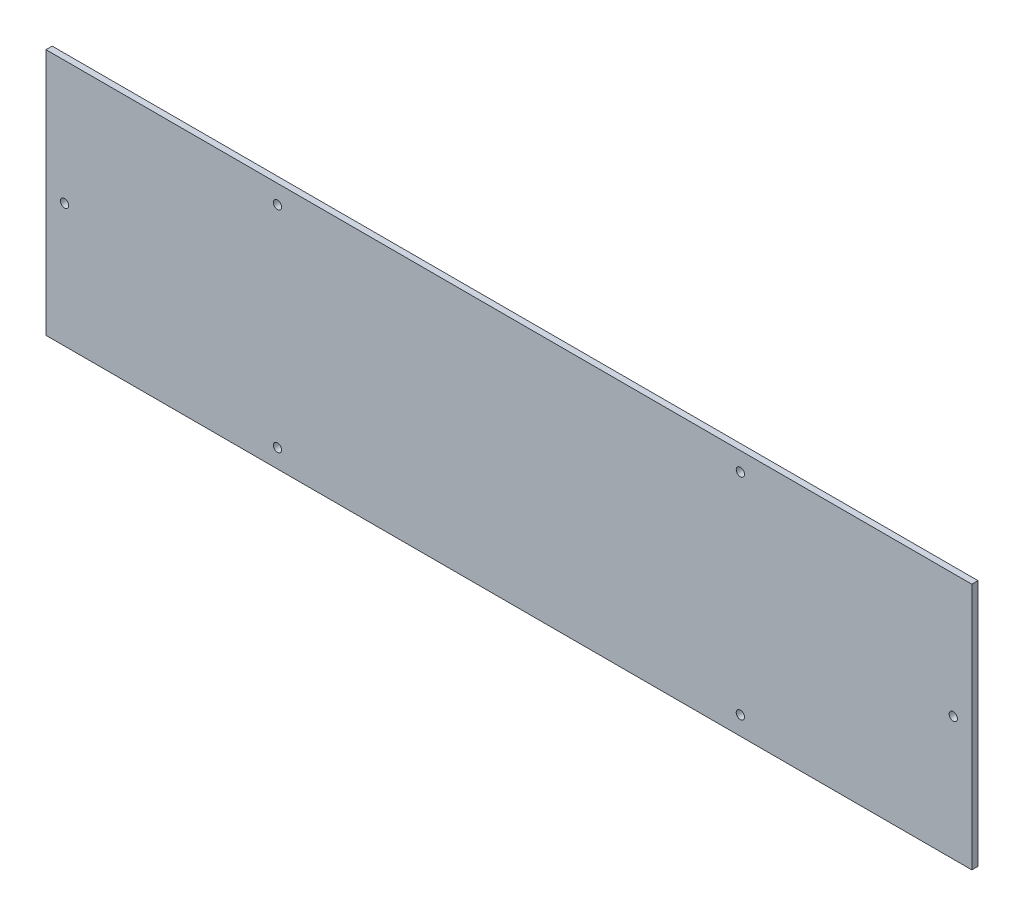
ISO-10303-21;
HEADER;
FILE_DESCRIPTION(('STEP AP214'),'2;1');
FILE_NAME('part.step','',(''),(''),'','','');
FILE_SCHEMA(('AUTOMOTIVE_DESIGN { 1 0 10303 214 1 1 1 1 }'));
ENDSEC;
DATA;
#1=APPLICATION_CONTEXT('core data for automotive mechanical design processes');
#2=APPLICATION_PROTOCOL_DEFINITION('international standard','automotive_design',2000,#1);
#3=PRODUCT_CONTEXT('',#1,'mechanical');
#4=PRODUCT('Part','Part','',(#3));
#5=PRODUCT_RELATED_PRODUCT_CATEGORY('part','',(#4));
#6=PRODUCT_DEFINITION_FORMATION('','',#4);
#7=PRODUCT_DEFINITION_CONTEXT('part definition',#1,'design');
#8=PRODUCT_DEFINITION('design','',#6,#7);
#9=PRODUCT_DEFINITION_SHAPE('','',#8);
#10=(LENGTH_UNIT() NAMED_UNIT(*) SI_UNIT(.MILLI.,.METRE.));
#11=(NAMED_UNIT(*) PLANE_ANGLE_UNIT() SI_UNIT($,.RADIAN.));
#12=(NAMED_UNIT(*) SI_UNIT($,.STERADIAN.) SOLID_ANGLE_UNIT());
#13=UNCERTAINTY_MEASURE_WITH_UNIT(LENGTH_MEASURE(1.E-05),#10,'distance_accuracy_value','');
#14=(GEOMETRIC_REPRESENTATION_CONTEXT(3) GLOBAL_UNCERTAINTY_ASSIGNED_CONTEXT((#13)) GLOBAL_UNIT_ASSIGNED_CONTEXT((#10,
#11,#12)) REPRESENTATION_CONTEXT('',''));
#15=CARTESIAN_POINT('',(0.,0.,0.));
#16=DIRECTION('',(0.,0.,1.));
#17=DIRECTION('',(1.,0.,0.));
#18=AXIS2_PLACEMENT_3D('',#15,#16,#17);
#19=CARTESIAN_POINT('',(0.,0.,3.));
#20=DIRECTION('',(0.,0.,-1.));
#21=DIRECTION('',(-1.,0.,0.));
#22=AXIS2_PLACEMENT_3D('',#19,#20,#21);
#23=PLANE('',#22);
#24=CARTESIAN_POINT('',(336.75,9.00000000000001,3.));
#25=DIRECTION('',(0.,0.,1.));
#26=DIRECTION('',(1.,0.,0.));
#27=AXIS2_PLACEMENT_3D('',#24,#25,#26);
#28=CIRCLE('',#27,2.);
#29=CARTESIAN_POINT('',(338.75,9.00000000000001,3.));
#30=VERTEX_POINT('',#29);
#31=EDGE_CURVE('E135',#30,#30,#28,.T.);
#32=ORIENTED_EDGE('',*,*,#31,.F.);
#33=EDGE_LOOP('',(#32));
#34=FACE_BOUND('',#33,.T.);
#35=CARTESIAN_POINT('',(112.25,111.,3.));
#36=DIRECTION('',(0.,0.,1.));
#37=DIRECTION('',(1.,0.,0.));
#38=AXIS2_PLACEMENT_3D('',#35,#36,#37);
#39=CIRCLE('',#38,2.);
#40=CARTESIAN_POINT('',(114.25,111.,3.));
#41=VERTEX_POINT('',#40);
#42=EDGE_CURVE('E123',#41,#41,#39,.T.);
#43=ORIENTED_EDGE('',*,*,#42,.F.);
#44=EDGE_LOOP('',(#43));
#45=FACE_BOUND('',#44,.T.);
#46=CARTESIAN_POINT('',(9.,60.,3.));
#47=DIRECTION('',(0.,0.,1.));
#48=DIRECTION('',(1.,0.,0.));
#49=AXIS2_PLACEMENT_3D('',#46,#47,#48);
#50=CIRCLE('',#49,2.);
#51=CARTESIAN_POINT('',(11.,60.,3.));
#52=VERTEX_POINT('',#51);
#53=EDGE_CURVE('E102',#52,#52,#50,.T.);
#54=ORIENTED_EDGE('',*,*,#53,.F.);
#55=EDGE_LOOP('',(#54));
#56=FACE_BOUND('',#55,.T.);
#57=DIRECTION('',(1.,0.,0.));
#58=VECTOR('',#57,1.);
#59=CARTESIAN_POINT('',(449.,0.,3.));
#60=LINE('',#59,#58);
#61=CARTESIAN_POINT('',(0.,0.,3.));
#62=VERTEX_POINT('',#61);
#63=CARTESIAN_POINT('',(449.,0.,3.));
#64=VERTEX_POINT('',#63);
#65=EDGE_CURVE('E87',#62,#64,#60,.T.);
#66=ORIENTED_EDGE('',*,*,#65,.T.);
#67=DIRECTION('',(0.,1.,0.));
#68=VECTOR('',#67,1.);
#69=CARTESIAN_POINT('',(449.,120.,3.));
#70=LINE('',#69,#68);
#71=CARTESIAN_POINT('',(449.,120.,3.));
#72=VERTEX_POINT('',#71);
#73=EDGE_CURVE('E82',#64,#72,#70,.T.);
#74=ORIENTED_EDGE('',*,*,#73,.T.);
#75=DIRECTION('',(-1.,0.,0.));
#76=VECTOR('',#75,1.);
#77=CARTESIAN_POINT('',(0.,120.,3.));
#78=LINE('',#77,#76);
#79=CARTESIAN_POINT('',(0.,120.,3.));
#80=VERTEX_POINT('',#79);
#81=EDGE_CURVE('E85',#72,#80,#78,.T.);
#82=ORIENTED_EDGE('',*,*,#81,.T.);
#83=DIRECTION('',(0.,-1.,0.));
#84=VECTOR('',#83,1.);
#85=CARTESIAN_POINT('',(0.,0.,3.));
#86=LINE('',#85,#84);
#87=EDGE_CURVE('E52',#80,#62,#86,.T.);
#88=ORIENTED_EDGE('',*,*,#87,.T.);
#89=EDGE_LOOP('',(#66,#74,#82,#88));
#90=FACE_BOUND('',#89,.T.);
#91=CARTESIAN_POINT('',(440.,60.,3.));
#92=DIRECTION('',(0.,0.,1.));
#93=DIRECTION('',(1.,0.,0.));
#94=AXIS2_PLACEMENT_3D('',#91,#92,#93);
#95=CIRCLE('',#94,2.);
#96=CARTESIAN_POINT('',(442.,60.,3.));
#97=VERTEX_POINT('',#96);
#98=EDGE_CURVE('E117',#97,#97,#95,.T.);
#99=ORIENTED_EDGE('',*,*,#98,.F.);
#100=EDGE_LOOP('',(#99));
#101=FACE_BOUND('',#100,.T.);
#102=CARTESIAN_POINT('',(336.75,111.,3.));
#103=DIRECTION('',(0.,0.,1.));
#104=DIRECTION('',(-1.,0.,0.));
#105=AXIS2_PLACEMENT_3D('',#102,#103,#104);
#106=CIRCLE('',#105,2.);
#107=CARTESIAN_POINT('',(334.75,111.,3.));
#108=VERTEX_POINT('',#107);
#109=EDGE_CURVE('E129',#108,#108,#106,.T.);
#110=ORIENTED_EDGE('',*,*,#109,.F.);
#111=EDGE_LOOP('',(#110));
#112=FACE_BOUND('',#111,.T.);
#113=CARTESIAN_POINT('',(112.25,9.00000000000001,3.));
#114=DIRECTION('',(0.,0.,1.));
#115=DIRECTION('',(-1.,0.,0.));
#116=AXIS2_PLACEMENT_3D('',#113,#114,#115);
#117=CIRCLE('',#116,2.);
#118=CARTESIAN_POINT('',(110.25,9.00000000000001,3.));
#119=VERTEX_POINT('',#118);
#120=EDGE_CURVE('E141',#119,#119,#117,.T.);
#121=ORIENTED_EDGE('',*,*,#120,.F.);
#122=EDGE_LOOP('',(#121));
#123=FACE_BOUND('',#122,.T.);
#124=ADVANCED_FACE('F35',(#34,#45,#56,#90,#101,#112,#123),#23,.F.);
#125=CARTESIAN_POINT('',(0.,0.,0.));
#126=DIRECTION('',(0.,0.,-1.));
#127=DIRECTION('',(-1.,0.,0.));
#128=AXIS2_PLACEMENT_3D('',#125,#126,#127);
#129=PLANE('',#128);
#130=CARTESIAN_POINT('',(336.75,9.00000000000001,0.));
#131=DIRECTION('',(0.,0.,1.));
#132=DIRECTION('',(1.,0.,0.));
#133=AXIS2_PLACEMENT_3D('',#130,#131,#132);
#134=CIRCLE('',#133,2.);
#135=CARTESIAN_POINT('',(338.75,9.00000000000001,0.));
#136=VERTEX_POINT('',#135);
#137=EDGE_CURVE('E138',#136,#136,#134,.T.);
#138=ORIENTED_EDGE('',*,*,#137,.T.);
#139=EDGE_LOOP('',(#138));
#140=FACE_BOUND('',#139,.T.);
#141=CARTESIAN_POINT('',(112.25,111.,0.));
#142=DIRECTION('',(0.,0.,1.));
#143=DIRECTION('',(1.,0.,0.));
#144=AXIS2_PLACEMENT_3D('',#141,#142,#143);
#145=CIRCLE('',#144,2.);
#146=CARTESIAN_POINT('',(114.25,111.,0.));
#147=VERTEX_POINT('',#146);
#148=EDGE_CURVE('E126',#147,#147,#145,.T.);
#149=ORIENTED_EDGE('',*,*,#148,.T.);
#150=EDGE_LOOP('',(#149));
#151=FACE_BOUND('',#150,.T.);
#152=CARTESIAN_POINT('',(9.,60.,0.));
#153=DIRECTION('',(0.,0.,1.));
#154=DIRECTION('',(1.,0.,0.));
#155=AXIS2_PLACEMENT_3D('',#152,#153,#154);
#156=CIRCLE('',#155,2.);
#157=CARTESIAN_POINT('',(11.,60.,0.));
#158=VERTEX_POINT('',#157);
#159=EDGE_CURVE('E114',#158,#158,#156,.T.);
#160=ORIENTED_EDGE('',*,*,#159,.T.);
#161=EDGE_LOOP('',(#160));
#162=FACE_BOUND('',#161,.T.);
#163=DIRECTION('',(1.,0.,0.));
#164=VECTOR('',#163,1.);
#165=CARTESIAN_POINT('',(449.,0.,0.));
#166=LINE('',#165,#164);
#167=CARTESIAN_POINT('',(0.,0.,0.));
#168=VERTEX_POINT('',#167);
#169=CARTESIAN_POINT('',(449.,0.,0.));
#170=VERTEX_POINT('',#169);
#171=EDGE_CURVE('E99',#168,#170,#166,.T.);
#172=ORIENTED_EDGE('',*,*,#171,.F.);
#173=DIRECTION('',(0.,-1.,0.));
#174=VECTOR('',#173,1.);
#175=CARTESIAN_POINT('',(0.,0.,0.));
#176=LINE('',#175,#174);
#177=CARTESIAN_POINT('',(0.,120.,0.));
#178=VERTEX_POINT('',#177);
#179=EDGE_CURVE('E75',#178,#168,#176,.T.);
#180=ORIENTED_EDGE('',*,*,#179,.F.);
#181=DIRECTION('',(-1.,0.,0.));
#182=VECTOR('',#181,1.);
#183=CARTESIAN_POINT('',(0.,120.,0.));
#184=LINE('',#183,#182);
#185=CARTESIAN_POINT('',(449.,120.,0.));
#186=VERTEX_POINT('',#185);
#187=EDGE_CURVE('E69',#186,#178,#184,.T.);
#188=ORIENTED_EDGE('',*,*,#187,.F.);
#189=DIRECTION('',(0.,1.,0.));
#190=VECTOR('',#189,1.);
#191=CARTESIAN_POINT('',(449.,120.,0.));
#192=LINE('',#191,#190);
#193=EDGE_CURVE('E91',#170,#186,#192,.T.);
#194=ORIENTED_EDGE('',*,*,#193,.F.);
#195=EDGE_LOOP('',(#172,#180,#188,#194));
#196=FACE_BOUND('',#195,.T.);
#197=CARTESIAN_POINT('',(440.,60.,0.));
#198=DIRECTION('',(0.,0.,1.));
#199=DIRECTION('',(1.,0.,0.));
#200=AXIS2_PLACEMENT_3D('',#197,#198,#199);
#201=CIRCLE('',#200,2.);
#202=CARTESIAN_POINT('',(442.,60.,0.));
#203=VERTEX_POINT('',#202);
#204=EDGE_CURVE('E120',#203,#203,#201,.T.);
#205=ORIENTED_EDGE('',*,*,#204,.T.);
#206=EDGE_LOOP('',(#205));
#207=FACE_BOUND('',#206,.T.);
#208=CARTESIAN_POINT('',(336.75,111.,0.));
#209=DIRECTION('',(0.,0.,1.));
#210=DIRECTION('',(-1.,0.,0.));
#211=AXIS2_PLACEMENT_3D('',#208,#209,#210);
#212=CIRCLE('',#211,2.);
#213=CARTESIAN_POINT('',(334.75,111.,0.));
#214=VERTEX_POINT('',#213);
#215=EDGE_CURVE('E132',#214,#214,#212,.T.);
#216=ORIENTED_EDGE('',*,*,#215,.T.);
#217=EDGE_LOOP('',(#216));
#218=FACE_BOUND('',#217,.T.);
#219=CARTESIAN_POINT('',(112.25,9.00000000000001,0.));
#220=DIRECTION('',(0.,0.,1.));
#221=DIRECTION('',(-1.,0.,0.));
#222=AXIS2_PLACEMENT_3D('',#219,#220,#221);
#223=CIRCLE('',#222,2.);
#224=CARTESIAN_POINT('',(110.25,9.00000000000001,0.));
#225=VERTEX_POINT('',#224);
#226=EDGE_CURVE('E144',#225,#225,#223,.T.);
#227=ORIENTED_EDGE('',*,*,#226,.T.);
#228=EDGE_LOOP('',(#227));
#229=FACE_BOUND('',#228,.T.);
#230=ADVANCED_FACE('F110',(#140,#151,#162,#196,#207,#218,#229),#129,.T.);
#231=CARTESIAN_POINT('',(449.,0.,3.));
#232=DIRECTION('',(0.,1.,0.));
#233=DIRECTION('',(-1.,0.,0.));
#234=AXIS2_PLACEMENT_3D('',#231,#232,#233);
#235=PLANE('',#234);
#236=ORIENTED_EDGE('',*,*,#171,.T.);
#237=DIRECTION('',(0.,0.,-1.));
#238=VECTOR('',#237,1.);
#239=CARTESIAN_POINT('',(449.,0.,3.));
#240=LINE('',#239,#238);
#241=EDGE_CURVE('E11',#64,#170,#240,.T.);
#242=ORIENTED_EDGE('',*,*,#241,.F.);
#243=ORIENTED_EDGE('',*,*,#65,.F.);
#244=DIRECTION('',(0.,0.,-1.));
#245=VECTOR('',#244,1.);
#246=CARTESIAN_POINT('',(0.,0.,3.));
#247=LINE('',#246,#245);
#248=EDGE_CURVE('E95',#62,#168,#247,.T.);
#249=ORIENTED_EDGE('',*,*,#248,.T.);
#250=EDGE_LOOP('',(#236,#242,#243,#249));
#251=FACE_BOUND('',#250,.T.);
#252=ADVANCED_FACE('F37',(#251),#235,.F.);
#253=CARTESIAN_POINT('',(449.,120.,3.));
#254=DIRECTION('',(-1.,0.,0.));
#255=DIRECTION('',(0.,0.,1.));
#256=AXIS2_PLACEMENT_3D('',#253,#254,#255);
#257=PLANE('',#256);
#258=ORIENTED_EDGE('',*,*,#193,.T.);
#259=DIRECTION('',(0.,0.,-1.));
#260=VECTOR('',#259,1.);
#261=CARTESIAN_POINT('',(449.,120.,3.));
#262=LINE('',#261,#260);
#263=EDGE_CURVE('E44',#72,#186,#262,.T.);
#264=ORIENTED_EDGE('',*,*,#263,.F.);
#265=ORIENTED_EDGE('',*,*,#73,.F.);
#266=ORIENTED_EDGE('',*,*,#241,.T.);
#267=EDGE_LOOP('',(#258,#264,#265,#266));
#268=FACE_BOUND('',#267,.T.);
#269=ADVANCED_FACE('F90',(#268),#257,.F.);
#270=CARTESIAN_POINT('',(0.,120.,3.));
#271=DIRECTION('',(0.,-1.,0.));
#272=DIRECTION('',(0.,0.,-1.));
#273=AXIS2_PLACEMENT_3D('',#270,#271,#272);
#274=PLANE('',#273);
#275=ORIENTED_EDGE('',*,*,#187,.T.);
#276=DIRECTION('',(0.,0.,-1.));
#277=VECTOR('',#276,1.);
#278=CARTESIAN_POINT('',(0.,120.,3.));
#279=LINE('',#278,#277);
#280=EDGE_CURVE('E92',#80,#178,#279,.T.);
#281=ORIENTED_EDGE('',*,*,#280,.F.);
#282=ORIENTED_EDGE('',*,*,#81,.F.);
#283=ORIENTED_EDGE('',*,*,#263,.T.);
#284=EDGE_LOOP('',(#275,#281,#282,#283));
#285=FACE_BOUND('',#284,.T.);
#286=ADVANCED_FACE('F93',(#285),#274,.F.);
#287=CARTESIAN_POINT('',(0.,0.,3.));
#288=DIRECTION('',(1.,0.,0.));
#289=DIRECTION('',(0.,1.,0.));
#290=AXIS2_PLACEMENT_3D('',#287,#288,#289);
#291=PLANE('',#290);
#292=ORIENTED_EDGE('',*,*,#179,.T.);
#293=ORIENTED_EDGE('',*,*,#248,.F.);
#294=ORIENTED_EDGE('',*,*,#87,.F.);
#295=ORIENTED_EDGE('',*,*,#280,.T.);
#296=EDGE_LOOP('',(#292,#293,#294,#295));
#297=FACE_BOUND('',#296,.T.);
#298=ADVANCED_FACE('F107',(#297),#291,.F.);
#299=CARTESIAN_POINT('',(9.,60.,3.));
#300=DIRECTION('',(0.,0.,-1.));
#301=DIRECTION('',(-1.,0.,0.));
#302=AXIS2_PLACEMENT_3D('',#299,#300,#301);
#303=CYLINDRICAL_SURFACE('',#302,2.);
#304=ORIENTED_EDGE('',*,*,#53,.T.);
#305=EDGE_LOOP('',(#304));
#306=FACE_BOUND('',#305,.T.);
#307=ORIENTED_EDGE('',*,*,#159,.F.);
#308=EDGE_LOOP('',(#307));
#309=FACE_BOUND('',#308,.T.);
#310=ADVANCED_FACE('F164',(#306,#309),#303,.F.);
#311=CARTESIAN_POINT('',(440.,60.,3.));
#312=DIRECTION('',(0.,0.,-1.));
#313=DIRECTION('',(-1.,0.,0.));
#314=AXIS2_PLACEMENT_3D('',#311,#312,#313);
#315=CYLINDRICAL_SURFACE('',#314,2.);
#316=ORIENTED_EDGE('',*,*,#98,.T.);
#317=EDGE_LOOP('',(#316));
#318=FACE_BOUND('',#317,.T.);
#319=ORIENTED_EDGE('',*,*,#204,.F.);
#320=EDGE_LOOP('',(#319));
#321=FACE_BOUND('',#320,.T.);
#322=ADVANCED_FACE('F212',(#318,#321),#315,.F.);
#323=CARTESIAN_POINT('',(112.25,111.,3.));
#324=DIRECTION('',(0.,0.,-1.));
#325=DIRECTION('',(-1.,0.,0.));
#326=AXIS2_PLACEMENT_3D('',#323,#324,#325);
#327=CYLINDRICAL_SURFACE('',#326,2.);
#328=ORIENTED_EDGE('',*,*,#42,.T.);
#329=EDGE_LOOP('',(#328));
#330=FACE_BOUND('',#329,.T.);
#331=ORIENTED_EDGE('',*,*,#148,.F.);
#332=EDGE_LOOP('',(#331));
#333=FACE_BOUND('',#332,.T.);
#334=ADVANCED_FACE('F220',(#330,#333),#327,.F.);
#335=CARTESIAN_POINT('',(336.75,111.,3.));
#336=DIRECTION('',(0.,0.,-1.));
#337=DIRECTION('',(-1.,0.,0.));
#338=AXIS2_PLACEMENT_3D('',#335,#336,#337);
#339=CYLINDRICAL_SURFACE('',#338,2.);
#340=ORIENTED_EDGE('',*,*,#109,.T.);
#341=EDGE_LOOP('',(#340));
#342=FACE_BOUND('',#341,.T.);
#343=ORIENTED_EDGE('',*,*,#215,.F.);
#344=EDGE_LOOP('',(#343));
#345=FACE_BOUND('',#344,.T.);
#346=ADVANCED_FACE('F228',(#342,#345),#339,.F.);
#347=CARTESIAN_POINT('',(336.75,9.00000000000001,3.));
#348=DIRECTION('',(0.,0.,-1.));
#349=DIRECTION('',(-1.,0.,0.));
#350=AXIS2_PLACEMENT_3D('',#347,#348,#349);
#351=CYLINDRICAL_SURFACE('',#350,2.);
#352=ORIENTED_EDGE('',*,*,#31,.T.);
#353=EDGE_LOOP('',(#352));
#354=FACE_BOUND('',#353,.T.);
#355=ORIENTED_EDGE('',*,*,#137,.F.);
#356=EDGE_LOOP('',(#355));
#357=FACE_BOUND('',#356,.T.);
#358=ADVANCED_FACE('F237',(#354,#357),#351,.F.);
#359=CARTESIAN_POINT('',(112.25,9.00000000000001,3.));
#360=DIRECTION('',(0.,0.,-1.));
#361=DIRECTION('',(-1.,0.,0.));
#362=AXIS2_PLACEMENT_3D('',#359,#360,#361);
#363=CYLINDRICAL_SURFACE('',#362,2.);
#364=ORIENTED_EDGE('',*,*,#120,.T.);
#365=EDGE_LOOP('',(#364));
#366=FACE_BOUND('',#365,.T.);
#367=ORIENTED_EDGE('',*,*,#226,.F.);
#368=EDGE_LOOP('',(#367));
#369=FACE_BOUND('',#368,.T.);
#370=ADVANCED_FACE('F150',(#366,#369),#363,.F.);
#371=CLOSED_SHELL('',(#124,#230,#252,#269,#286,#298,#310,#322,#334,#346,#358,#370));
#372=MANIFOLD_SOLID_BREP('B2',#371);
#373=ADVANCED_BREP_SHAPE_REPRESENTATION('',(#18,#372),#14);
#374=SHAPE_DEFINITION_REPRESENTATION(#9,#373);
ENDSEC;
END-ISO-10303-21;
